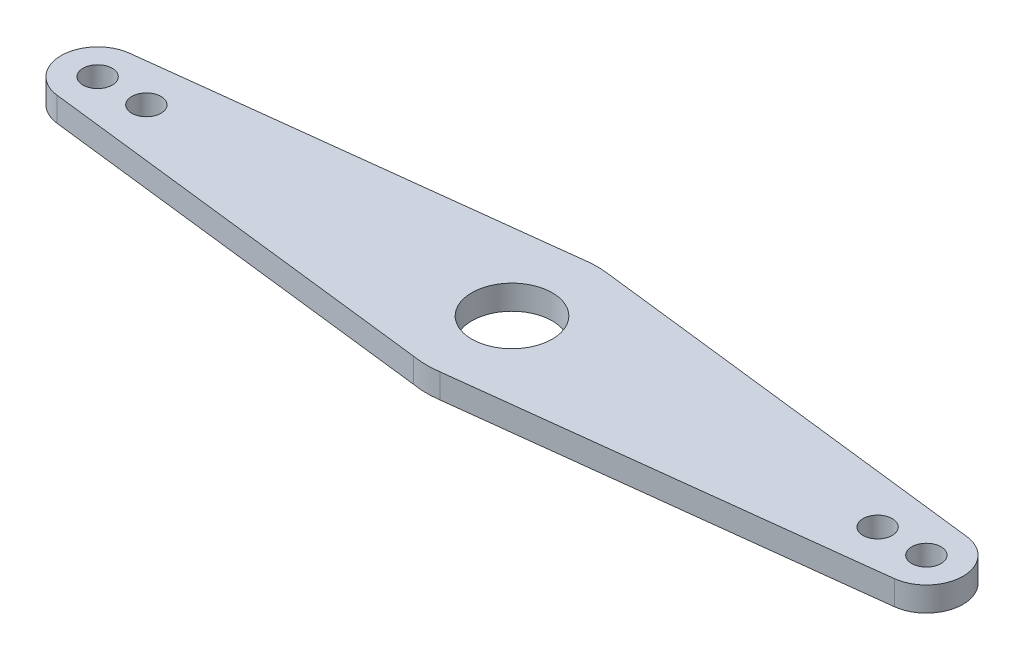
ISO-10303-21;
HEADER;
FILE_DESCRIPTION(('STEP AP214'),'2;1');
FILE_NAME('part.step','',(''),(''),'','','');
FILE_SCHEMA(('AUTOMOTIVE_DESIGN { 1 0 10303 214 1 1 1 1 }'));
ENDSEC;
DATA;
#1=APPLICATION_CONTEXT('core data for automotive mechanical design processes');
#2=APPLICATION_PROTOCOL_DEFINITION('international standard','automotive_design',2000,#1);
#3=PRODUCT_CONTEXT('',#1,'mechanical');
#4=PRODUCT('Part','Part','',(#3));
#5=PRODUCT_RELATED_PRODUCT_CATEGORY('part','',(#4));
#6=PRODUCT_DEFINITION_FORMATION('','',#4);
#7=PRODUCT_DEFINITION_CONTEXT('part definition',#1,'design');
#8=PRODUCT_DEFINITION('design','',#6,#7);
#9=PRODUCT_DEFINITION_SHAPE('','',#8);
#10=(LENGTH_UNIT() NAMED_UNIT(*) SI_UNIT(.MILLI.,.METRE.));
#11=(NAMED_UNIT(*) PLANE_ANGLE_UNIT() SI_UNIT($,.RADIAN.));
#12=(NAMED_UNIT(*) SI_UNIT($,.STERADIAN.) SOLID_ANGLE_UNIT());
#13=UNCERTAINTY_MEASURE_WITH_UNIT(LENGTH_MEASURE(1.E-05),#10,'distance_accuracy_value','');
#14=(GEOMETRIC_REPRESENTATION_CONTEXT(3) GLOBAL_UNCERTAINTY_ASSIGNED_CONTEXT((#13)) GLOBAL_UNIT_ASSIGNED_CONTEXT((#10,
#11,#12)) REPRESENTATION_CONTEXT('',''));
#15=CARTESIAN_POINT('',(0.,0.,0.));
#16=DIRECTION('',(0.,0.,1.));
#17=DIRECTION('',(1.,0.,0.));
#18=AXIS2_PLACEMENT_3D('',#15,#16,#17);
#19=CARTESIAN_POINT('',(-170.,10.,0.));
#20=DIRECTION('',(0.,-1.,0.));
#21=DIRECTION('',(0.,0.,-1.));
#22=AXIS2_PLACEMENT_3D('',#19,#20,#21);
#23=CYLINDRICAL_SURFACE('',#22,15.);
#24=CARTESIAN_POINT('',(-170.,0.,0.));
#25=DIRECTION('',(0.,1.,0.));
#26=DIRECTION('',(0.,0.,1.));
#27=AXIS2_PLACEMENT_3D('',#24,#25,#26);
#28=CIRCLE('',#27,15.);
#29=CARTESIAN_POINT('',(-171.764705882353,0.,-14.8958320730595));
#30=VERTEX_POINT('',#29);
#31=CARTESIAN_POINT('',(-171.759908797174,0.,14.896399599421));
#32=VERTEX_POINT('',#31);
#33=EDGE_CURVE('E135',#30,#32,#28,.T.);
#34=ORIENTED_EDGE('',*,*,#33,.T.);
#35=DIRECTION('',(0.,-1.,0.));
#36=VECTOR('',#35,1.);
#37=CARTESIAN_POINT('',(-171.759908797174,10.,14.896399599421));
#38=LINE('',#37,#36);
#39=CARTESIAN_POINT('',(-171.759908797174,10.,14.896399599421));
#40=VERTEX_POINT('',#39);
#41=EDGE_CURVE('E11',#40,#32,#38,.T.);
#42=ORIENTED_EDGE('',*,*,#41,.F.);
#43=CARTESIAN_POINT('',(-170.,10.,0.));
#44=DIRECTION('',(0.,1.,0.));
#45=DIRECTION('',(0.,0.,1.));
#46=AXIS2_PLACEMENT_3D('',#43,#44,#45);
#47=CIRCLE('',#46,15.);
#48=CARTESIAN_POINT('',(-171.764705882353,10.,-14.8958320730595));
#49=VERTEX_POINT('',#48);
#50=EDGE_CURVE('E150',#49,#40,#47,.T.);
#51=ORIENTED_EDGE('',*,*,#50,.F.);
#52=DIRECTION('',(0.,-1.,0.));
#53=VECTOR('',#52,1.);
#54=CARTESIAN_POINT('',(-171.764705882353,10.,-14.8958320730595));
#55=LINE('',#54,#53);
#56=EDGE_CURVE('E131',#49,#30,#55,.T.);
#57=ORIENTED_EDGE('',*,*,#56,.T.);
#58=EDGE_LOOP('',(#34,#42,#51,#57));
#59=FACE_BOUND('',#58,.T.);
#60=ADVANCED_FACE('F39',(#59),#23,.T.);
#61=CARTESIAN_POINT('',(-6.03666610789498,10.,34.4754791453548));
#62=DIRECTION('',(0.117327253144939,0.,-0.993093306628065));
#63=DIRECTION('',(-0.993093306628065,0.,-0.117327253144939));
#64=AXIS2_PLACEMENT_3D('',#61,#62,#63);
#65=PLANE('',#64);
#66=DIRECTION('',(0.993093306628065,0.,0.117327253144939));
#67=VECTOR('',#66,1.);
#68=CARTESIAN_POINT('',(-6.03666610789498,0.,34.4754791453548));
#69=LINE('',#68,#67);
#70=CARTESIAN_POINT('',(-6.03666610789498,0.,34.4754791453548));
#71=VERTEX_POINT('',#70);
#72=EDGE_CURVE('E138',#32,#71,#69,.T.);
#73=ORIENTED_EDGE('',*,*,#72,.T.);
#74=DIRECTION('',(0.,-1.,0.));
#75=VECTOR('',#74,1.);
#76=CARTESIAN_POINT('',(-6.03666610789498,10.,34.4754791453548));
#77=LINE('',#76,#75);
#78=CARTESIAN_POINT('',(-6.03666610789498,10.,34.4754791453548));
#79=VERTEX_POINT('',#78);
#80=EDGE_CURVE('E47',#79,#71,#77,.T.);
#81=ORIENTED_EDGE('',*,*,#80,.F.);
#82=DIRECTION('',(0.993093306628065,0.,0.117327253144939));
#83=VECTOR('',#82,1.);
#84=CARTESIAN_POINT('',(-6.03666610789498,10.,34.4754791453548));
#85=LINE('',#84,#83);
#86=EDGE_CURVE('E98',#40,#79,#85,.T.);
#87=ORIENTED_EDGE('',*,*,#86,.F.);
#88=ORIENTED_EDGE('',*,*,#41,.T.);
#89=EDGE_LOOP('',(#73,#81,#87,#88));
#90=FACE_BOUND('',#89,.T.);
#91=ADVANCED_FACE('F250',(#90),#65,.F.);
#92=CARTESIAN_POINT('',(0.,10.,0.));
#93=DIRECTION('',(0.,-1.,0.));
#94=DIRECTION('',(0.,0.,-1.));
#95=AXIS2_PLACEMENT_3D('',#92,#93,#94);
#96=CYLINDRICAL_SURFACE('',#95,35.);
#97=CARTESIAN_POINT('',(0.,0.,0.));
#98=DIRECTION('',(0.,1.,0.));
#99=DIRECTION('',(0.,0.,1.));
#100=AXIS2_PLACEMENT_3D('',#97,#98,#99);
#101=CIRCLE('',#100,35.);
#102=CARTESIAN_POINT('',(5.11868310567351,0.,34.6236780724361));
#103=VERTEX_POINT('',#102);
#104=EDGE_CURVE('E141',#71,#103,#101,.T.);
#105=ORIENTED_EDGE('',*,*,#104,.T.);
#106=DIRECTION('',(0.,-1.,0.));
#107=VECTOR('',#106,1.);
#108=CARTESIAN_POINT('',(5.11868310567351,10.,34.6236780724361));
#109=LINE('',#108,#107);
#110=CARTESIAN_POINT('',(5.11868310567351,10.,34.6236780724361));
#111=VERTEX_POINT('',#110);
#112=EDGE_CURVE('E157',#111,#103,#109,.T.);
#113=ORIENTED_EDGE('',*,*,#112,.F.);
#114=CARTESIAN_POINT('',(0.,10.,0.));
#115=DIRECTION('',(0.,1.,0.));
#116=DIRECTION('',(0.,0.,1.));
#117=AXIS2_PLACEMENT_3D('',#114,#115,#116);
#118=CIRCLE('',#117,35.);
#119=EDGE_CURVE('E165',#79,#111,#118,.T.);
#120=ORIENTED_EDGE('',*,*,#119,.F.);
#121=ORIENTED_EDGE('',*,*,#80,.T.);
#122=EDGE_LOOP('',(#105,#113,#120,#121));
#123=FACE_BOUND('',#122,.T.);
#124=ADVANCED_FACE('F163',(#123),#96,.T.);
#125=CARTESIAN_POINT('',(5.11868310567351,10.,34.6236780724361));
#126=DIRECTION('',(-0.117560842167454,0.,-0.99306568181006));
#127=DIRECTION('',(-0.99306568181006,0.,0.117560842167454));
#128=AXIS2_PLACEMENT_3D('',#125,#126,#127);
#129=PLANE('',#128);
#130=DIRECTION('',(0.99306568181006,0.,-0.117560842167454));
#131=VECTOR('',#130,1.);
#132=CARTESIAN_POINT('',(5.11868310567351,0.,34.6236780724361));
#133=LINE('',#132,#131);
#134=CARTESIAN_POINT('',(171.763412632512,0.,14.8959852271509));
#135=VERTEX_POINT('',#134);
#136=EDGE_CURVE('E143',#103,#135,#133,.T.);
#137=ORIENTED_EDGE('',*,*,#136,.T.);
#138=DIRECTION('',(0.,-1.,0.));
#139=VECTOR('',#138,1.);
#140=CARTESIAN_POINT('',(171.763412632512,10.,14.8959852271509));
#141=LINE('',#140,#139);
#142=CARTESIAN_POINT('',(171.763412632512,10.,14.8959852271509));
#143=VERTEX_POINT('',#142);
#144=EDGE_CURVE('E154',#143,#135,#141,.T.);
#145=ORIENTED_EDGE('',*,*,#144,.F.);
#146=DIRECTION('',(0.99306568181006,0.,-0.117560842167454));
#147=VECTOR('',#146,1.);
#148=CARTESIAN_POINT('',(5.11868310567351,10.,34.6236780724361));
#149=LINE('',#148,#147);
#150=EDGE_CURVE('E177',#111,#143,#149,.T.);
#151=ORIENTED_EDGE('',*,*,#150,.F.);
#152=ORIENTED_EDGE('',*,*,#112,.T.);
#153=EDGE_LOOP('',(#137,#145,#151,#152));
#154=FACE_BOUND('',#153,.T.);
#155=ADVANCED_FACE('F173',(#154),#129,.F.);
#156=CARTESIAN_POINT('',(170.,10.,0.));
#157=DIRECTION('',(0.,-1.,0.));
#158=DIRECTION('',(0.,0.,-1.));
#159=AXIS2_PLACEMENT_3D('',#156,#157,#158);
#160=CYLINDRICAL_SURFACE('',#159,15.);
#161=CARTESIAN_POINT('',(170.,0.,0.));
#162=DIRECTION('',(0.,1.,0.));
#163=DIRECTION('',(0.,0.,1.));
#164=AXIS2_PLACEMENT_3D('',#161,#162,#163);
#165=CIRCLE('',#164,15.);
#166=CARTESIAN_POINT('',(171.764705882353,0.,-14.8958320730596));
#167=VERTEX_POINT('',#166);
#168=EDGE_CURVE('E145',#135,#167,#165,.T.);
#169=ORIENTED_EDGE('',*,*,#168,.T.);
#170=DIRECTION('',(0.,-1.,0.));
#171=VECTOR('',#170,1.);
#172=CARTESIAN_POINT('',(171.764705882353,10.,-14.8958320730596));
#173=LINE('',#172,#171);
#174=CARTESIAN_POINT('',(171.764705882353,10.,-14.8958320730596));
#175=VERTEX_POINT('',#174);
#176=EDGE_CURVE('E126',#175,#167,#173,.T.);
#177=ORIENTED_EDGE('',*,*,#176,.F.);
#178=CARTESIAN_POINT('',(170.,10.,0.));
#179=DIRECTION('',(0.,1.,0.));
#180=DIRECTION('',(0.,0.,1.));
#181=AXIS2_PLACEMENT_3D('',#178,#179,#180);
#182=CIRCLE('',#181,15.);
#183=EDGE_CURVE('E117',#143,#175,#182,.T.);
#184=ORIENTED_EDGE('',*,*,#183,.F.);
#185=ORIENTED_EDGE('',*,*,#144,.T.);
#186=EDGE_LOOP('',(#169,#177,#184,#185));
#187=FACE_BOUND('',#186,.T.);
#188=ADVANCED_FACE('F176',(#187),#160,.T.);
#189=CARTESIAN_POINT('',(4.11764705882353,10.,-34.7569415038056));
#190=DIRECTION('',(-0.117647058823529,0.,0.993055471537302));
#191=DIRECTION('',(0.993055471537302,0.,0.117647058823529));
#192=AXIS2_PLACEMENT_3D('',#189,#190,#191);
#193=PLANE('',#192);
#194=DIRECTION('',(-0.993055471537302,0.,-0.117647058823529));
#195=VECTOR('',#194,1.);
#196=CARTESIAN_POINT('',(4.11764705882353,0.,-34.7569415038056));
#197=LINE('',#196,#195);
#198=CARTESIAN_POINT('',(4.11764705882353,0.,-34.7569415038056));
#199=VERTEX_POINT('',#198);
#200=EDGE_CURVE('E125',#167,#199,#197,.T.);
#201=ORIENTED_EDGE('',*,*,#200,.T.);
#202=DIRECTION('',(0.,-1.,0.));
#203=VECTOR('',#202,1.);
#204=CARTESIAN_POINT('',(4.11764705882353,10.,-34.7569415038056));
#205=LINE('',#204,#203);
#206=CARTESIAN_POINT('',(4.11764705882353,10.,-34.7569415038056));
#207=VERTEX_POINT('',#206);
#208=EDGE_CURVE('E122',#207,#199,#205,.T.);
#209=ORIENTED_EDGE('',*,*,#208,.F.);
#210=DIRECTION('',(-0.993055471537302,0.,-0.117647058823529));
#211=VECTOR('',#210,1.);
#212=CARTESIAN_POINT('',(4.11764705882353,10.,-34.7569415038056));
#213=LINE('',#212,#211);
#214=EDGE_CURVE('E111',#175,#207,#213,.T.);
#215=ORIENTED_EDGE('',*,*,#214,.F.);
#216=ORIENTED_EDGE('',*,*,#176,.T.);
#217=EDGE_LOOP('',(#201,#209,#215,#216));
#218=FACE_BOUND('',#217,.T.);
#219=ADVANCED_FACE('F123',(#218),#193,.F.);
#220=CARTESIAN_POINT('',(0.,10.,0.));
#221=DIRECTION('',(0.,-1.,0.));
#222=DIRECTION('',(0.,0.,-1.));
#223=AXIS2_PLACEMENT_3D('',#220,#221,#222);
#224=CYLINDRICAL_SURFACE('',#223,35.);
#225=CARTESIAN_POINT('',(0.,0.,0.));
#226=DIRECTION('',(0.,1.,0.));
#227=DIRECTION('',(0.,0.,1.));
#228=AXIS2_PLACEMENT_3D('',#225,#226,#227);
#229=CIRCLE('',#228,35.);
#230=CARTESIAN_POINT('',(-4.11764705882353,0.,-34.7569415038056));
#231=VERTEX_POINT('',#230);
#232=EDGE_CURVE('E84',#199,#231,#229,.T.);
#233=ORIENTED_EDGE('',*,*,#232,.T.);
#234=DIRECTION('',(0.,-1.,0.));
#235=VECTOR('',#234,1.);
#236=CARTESIAN_POINT('',(-4.11764705882353,10.,-34.7569415038056));
#237=LINE('',#236,#235);
#238=CARTESIAN_POINT('',(-4.11764705882353,10.,-34.7569415038056));
#239=VERTEX_POINT('',#238);
#240=EDGE_CURVE('E127',#239,#231,#237,.T.);
#241=ORIENTED_EDGE('',*,*,#240,.F.);
#242=CARTESIAN_POINT('',(0.,10.,0.));
#243=DIRECTION('',(0.,1.,0.));
#244=DIRECTION('',(0.,0.,1.));
#245=AXIS2_PLACEMENT_3D('',#242,#243,#244);
#246=CIRCLE('',#245,35.);
#247=EDGE_CURVE('E115',#207,#239,#246,.T.);
#248=ORIENTED_EDGE('',*,*,#247,.F.);
#249=ORIENTED_EDGE('',*,*,#208,.T.);
#250=EDGE_LOOP('',(#233,#241,#248,#249));
#251=FACE_BOUND('',#250,.T.);
#252=ADVANCED_FACE('F129',(#251),#224,.T.);
#253=CARTESIAN_POINT('',(-171.764705882353,10.,-14.8958320730595));
#254=DIRECTION('',(0.11764705882353,0.,0.993055471537302));
#255=DIRECTION('',(0.993055471537302,0.,-0.11764705882353));
#256=AXIS2_PLACEMENT_3D('',#253,#254,#255);
#257=PLANE('',#256);
#258=DIRECTION('',(-0.993055471537302,0.,0.11764705882353));
#259=VECTOR('',#258,1.);
#260=CARTESIAN_POINT('',(-171.764705882353,0.,-14.8958320730595));
#261=LINE('',#260,#259);
#262=EDGE_CURVE('E90',#231,#30,#261,.T.);
#263=ORIENTED_EDGE('',*,*,#262,.T.);
#264=ORIENTED_EDGE('',*,*,#56,.F.);
#265=DIRECTION('',(-0.993055471537302,0.,0.11764705882353));
#266=VECTOR('',#265,1.);
#267=CARTESIAN_POINT('',(-171.764705882353,10.,-14.8958320730595));
#268=LINE('',#267,#266);
#269=EDGE_CURVE('E55',#239,#49,#268,.T.);
#270=ORIENTED_EDGE('',*,*,#269,.F.);
#271=ORIENTED_EDGE('',*,*,#240,.T.);
#272=EDGE_LOOP('',(#263,#264,#270,#271));
#273=FACE_BOUND('',#272,.T.);
#274=ADVANCED_FACE('F224',(#273),#257,.F.);
#275=CARTESIAN_POINT('',(-170.,10.,0.));
#276=DIRECTION('',(0.,1.,0.));
#277=DIRECTION('',(0.,0.,1.));
#278=AXIS2_PLACEMENT_3D('',#275,#276,#277);
#279=PLANE('',#278);
#280=CARTESIAN_POINT('',(0.,10.,0.));
#281=DIRECTION('',(0.,1.,0.));
#282=DIRECTION('',(0.,0.,1.));
#283=AXIS2_PLACEMENT_3D('',#280,#281,#282);
#284=CIRCLE('',#283,16.5);
#285=CARTESIAN_POINT('',(0.,10.,16.5));
#286=VERTEX_POINT('',#285);
#287=EDGE_CURVE('E207',#286,#286,#284,.T.);
#288=ORIENTED_EDGE('',*,*,#287,.F.);
#289=EDGE_LOOP('',(#288));
#290=FACE_BOUND('',#289,.T.);
#291=CARTESIAN_POINT('',(170.,10.,0.));
#292=DIRECTION('',(0.,1.,0.));
#293=DIRECTION('',(0.,0.,1.));
#294=AXIS2_PLACEMENT_3D('',#291,#292,#293);
#295=CIRCLE('',#294,6.00000000000002);
#296=CARTESIAN_POINT('',(170.,10.,5.99999999999999));
#297=VERTEX_POINT('',#296);
#298=EDGE_CURVE('E202',#297,#297,#295,.T.);
#299=ORIENTED_EDGE('',*,*,#298,.F.);
#300=EDGE_LOOP('',(#299));
#301=FACE_BOUND('',#300,.T.);
#302=CARTESIAN_POINT('',(-170.,10.,0.));
#303=DIRECTION('',(0.,1.,0.));
#304=DIRECTION('',(0.,0.,1.));
#305=AXIS2_PLACEMENT_3D('',#302,#303,#304);
#306=CIRCLE('',#305,6.00000000000002);
#307=CARTESIAN_POINT('',(-170.,10.,6.00000000000004));
#308=VERTEX_POINT('',#307);
#309=EDGE_CURVE('E199',#308,#308,#306,.T.);
#310=ORIENTED_EDGE('',*,*,#309,.F.);
#311=EDGE_LOOP('',(#310));
#312=FACE_BOUND('',#311,.T.);
#313=CARTESIAN_POINT('',(-150.,10.,0.));
#314=DIRECTION('',(0.,1.,0.));
#315=DIRECTION('',(0.,0.,1.));
#316=AXIS2_PLACEMENT_3D('',#313,#314,#315);
#317=CIRCLE('',#316,6.00000000000002);
#318=CARTESIAN_POINT('',(-150.,10.,6.00000000000004));
#319=VERTEX_POINT('',#318);
#320=EDGE_CURVE('E193',#319,#319,#317,.T.);
#321=ORIENTED_EDGE('',*,*,#320,.F.);
#322=EDGE_LOOP('',(#321));
#323=FACE_BOUND('',#322,.T.);
#324=CARTESIAN_POINT('',(150.,10.,0.));
#325=DIRECTION('',(0.,1.,0.));
#326=DIRECTION('',(0.,0.,1.));
#327=AXIS2_PLACEMENT_3D('',#324,#325,#326);
#328=CIRCLE('',#327,6.00000000000002);
#329=CARTESIAN_POINT('',(150.,10.,5.99999999999999));
#330=VERTEX_POINT('',#329);
#331=EDGE_CURVE('E186',#330,#330,#328,.T.);
#332=ORIENTED_EDGE('',*,*,#331,.F.);
#333=EDGE_LOOP('',(#332));
#334=FACE_BOUND('',#333,.T.);
#335=ORIENTED_EDGE('',*,*,#50,.T.);
#336=ORIENTED_EDGE('',*,*,#86,.T.);
#337=ORIENTED_EDGE('',*,*,#119,.T.);
#338=ORIENTED_EDGE('',*,*,#150,.T.);
#339=ORIENTED_EDGE('',*,*,#183,.T.);
#340=ORIENTED_EDGE('',*,*,#214,.T.);
#341=ORIENTED_EDGE('',*,*,#247,.T.);
#342=ORIENTED_EDGE('',*,*,#269,.T.);
#343=EDGE_LOOP('',(#335,#336,#337,#338,#339,#340,#341,#342));
#344=FACE_BOUND('',#343,.T.);
#345=ADVANCED_FACE('F113',(#290,#301,#312,#323,#334,#344),#279,.T.);
#346=CARTESIAN_POINT('',(-170.,0.,0.));
#347=DIRECTION('',(0.,1.,0.));
#348=DIRECTION('',(0.,0.,1.));
#349=AXIS2_PLACEMENT_3D('',#346,#347,#348);
#350=PLANE('',#349);
#351=CARTESIAN_POINT('',(0.,0.,0.));
#352=DIRECTION('',(0.,1.,0.));
#353=DIRECTION('',(0.,0.,1.));
#354=AXIS2_PLACEMENT_3D('',#351,#352,#353);
#355=CIRCLE('',#354,16.5);
#356=CARTESIAN_POINT('',(0.,0.,16.5));
#357=VERTEX_POINT('',#356);
#358=EDGE_CURVE('E187',#357,#357,#355,.T.);
#359=ORIENTED_EDGE('',*,*,#358,.T.);
#360=EDGE_LOOP('',(#359));
#361=FACE_BOUND('',#360,.T.);
#362=CARTESIAN_POINT('',(170.,0.,0.));
#363=DIRECTION('',(0.,1.,0.));
#364=DIRECTION('',(0.,0.,1.));
#365=AXIS2_PLACEMENT_3D('',#362,#363,#364);
#366=CIRCLE('',#365,6.00000000000002);
#367=CARTESIAN_POINT('',(170.,0.,5.99999999999999));
#368=VERTEX_POINT('',#367);
#369=EDGE_CURVE('E139',#368,#368,#366,.T.);
#370=ORIENTED_EDGE('',*,*,#369,.T.);
#371=EDGE_LOOP('',(#370));
#372=FACE_BOUND('',#371,.T.);
#373=CARTESIAN_POINT('',(-170.,0.,0.));
#374=DIRECTION('',(0.,1.,0.));
#375=DIRECTION('',(0.,0.,1.));
#376=AXIS2_PLACEMENT_3D('',#373,#374,#375);
#377=CIRCLE('',#376,6.00000000000002);
#378=CARTESIAN_POINT('',(-170.,0.,6.00000000000004));
#379=VERTEX_POINT('',#378);
#380=EDGE_CURVE('E196',#379,#379,#377,.T.);
#381=ORIENTED_EDGE('',*,*,#380,.T.);
#382=EDGE_LOOP('',(#381));
#383=FACE_BOUND('',#382,.T.);
#384=CARTESIAN_POINT('',(-150.,0.,0.));
#385=DIRECTION('',(0.,1.,0.));
#386=DIRECTION('',(0.,0.,1.));
#387=AXIS2_PLACEMENT_3D('',#384,#385,#386);
#388=CIRCLE('',#387,6.00000000000002);
#389=CARTESIAN_POINT('',(-150.,0.,6.00000000000004));
#390=VERTEX_POINT('',#389);
#391=EDGE_CURVE('E190',#390,#390,#388,.T.);
#392=ORIENTED_EDGE('',*,*,#391,.T.);
#393=EDGE_LOOP('',(#392));
#394=FACE_BOUND('',#393,.T.);
#395=CARTESIAN_POINT('',(150.,0.,0.));
#396=DIRECTION('',(0.,1.,0.));
#397=DIRECTION('',(0.,0.,1.));
#398=AXIS2_PLACEMENT_3D('',#395,#396,#397);
#399=CIRCLE('',#398,6.00000000000002);
#400=CARTESIAN_POINT('',(150.,0.,5.99999999999999));
#401=VERTEX_POINT('',#400);
#402=EDGE_CURVE('E183',#401,#401,#399,.T.);
#403=ORIENTED_EDGE('',*,*,#402,.T.);
#404=EDGE_LOOP('',(#403));
#405=FACE_BOUND('',#404,.T.);
#406=ORIENTED_EDGE('',*,*,#33,.F.);
#407=ORIENTED_EDGE('',*,*,#262,.F.);
#408=ORIENTED_EDGE('',*,*,#232,.F.);
#409=ORIENTED_EDGE('',*,*,#200,.F.);
#410=ORIENTED_EDGE('',*,*,#168,.F.);
#411=ORIENTED_EDGE('',*,*,#136,.F.);
#412=ORIENTED_EDGE('',*,*,#104,.F.);
#413=ORIENTED_EDGE('',*,*,#72,.F.);
#414=EDGE_LOOP('',(#406,#407,#408,#409,#410,#411,#412,#413));
#415=FACE_BOUND('',#414,.T.);
#416=ADVANCED_FACE('F169',(#361,#372,#383,#394,#405,#415),#350,.F.);
#417=CARTESIAN_POINT('',(150.,0.,0.));
#418=DIRECTION('',(0.,1.,0.));
#419=DIRECTION('',(0.,0.,1.));
#420=AXIS2_PLACEMENT_3D('',#417,#418,#419);
#421=CYLINDRICAL_SURFACE('',#420,6.00000000000002);
#422=ORIENTED_EDGE('',*,*,#402,.F.);
#423=EDGE_LOOP('',(#422));
#424=FACE_BOUND('',#423,.T.);
#425=ORIENTED_EDGE('',*,*,#331,.T.);
#426=EDGE_LOOP('',(#425));
#427=FACE_BOUND('',#426,.T.);
#428=ADVANCED_FACE('F234',(#424,#427),#421,.F.);
#429=CARTESIAN_POINT('',(-150.,0.,0.));
#430=DIRECTION('',(0.,1.,0.));
#431=DIRECTION('',(0.,0.,1.));
#432=AXIS2_PLACEMENT_3D('',#429,#430,#431);
#433=CYLINDRICAL_SURFACE('',#432,6.00000000000002);
#434=ORIENTED_EDGE('',*,*,#391,.F.);
#435=EDGE_LOOP('',(#434));
#436=FACE_BOUND('',#435,.T.);
#437=ORIENTED_EDGE('',*,*,#320,.T.);
#438=EDGE_LOOP('',(#437));
#439=FACE_BOUND('',#438,.T.);
#440=ADVANCED_FACE('F236',(#436,#439),#433,.F.);
#441=CARTESIAN_POINT('',(-170.,0.,0.));
#442=DIRECTION('',(0.,1.,0.));
#443=DIRECTION('',(0.,0.,1.));
#444=AXIS2_PLACEMENT_3D('',#441,#442,#443);
#445=CYLINDRICAL_SURFACE('',#444,6.00000000000002);
#446=ORIENTED_EDGE('',*,*,#380,.F.);
#447=EDGE_LOOP('',(#446));
#448=FACE_BOUND('',#447,.T.);
#449=ORIENTED_EDGE('',*,*,#309,.T.);
#450=EDGE_LOOP('',(#449));
#451=FACE_BOUND('',#450,.T.);
#452=ADVANCED_FACE('F243',(#448,#451),#445,.F.);
#453=CARTESIAN_POINT('',(170.,0.,0.));
#454=DIRECTION('',(0.,1.,0.));
#455=DIRECTION('',(0.,0.,1.));
#456=AXIS2_PLACEMENT_3D('',#453,#454,#455);
#457=CYLINDRICAL_SURFACE('',#456,6.00000000000002);
#458=ORIENTED_EDGE('',*,*,#369,.F.);
#459=EDGE_LOOP('',(#458));
#460=FACE_BOUND('',#459,.T.);
#461=ORIENTED_EDGE('',*,*,#298,.T.);
#462=EDGE_LOOP('',(#461));
#463=FACE_BOUND('',#462,.T.);
#464=ADVANCED_FACE('F218',(#460,#463),#457,.F.);
#465=CARTESIAN_POINT('',(0.,0.,0.));
#466=DIRECTION('',(0.,1.,0.));
#467=DIRECTION('',(0.,0.,1.));
#468=AXIS2_PLACEMENT_3D('',#465,#466,#467);
#469=CYLINDRICAL_SURFACE('',#468,16.5);
#470=ORIENTED_EDGE('',*,*,#358,.F.);
#471=EDGE_LOOP('',(#470));
#472=FACE_BOUND('',#471,.T.);
#473=ORIENTED_EDGE('',*,*,#287,.T.);
#474=EDGE_LOOP('',(#473));
#475=FACE_BOUND('',#474,.T.);
#476=ADVANCED_FACE('F215',(#472,#475),#469,.F.);
#477=CLOSED_SHELL('',(#60,#91,#124,#155,#188,#219,#252,#274,#345,#416,#428,#440,#452,#464,#476));
#478=MANIFOLD_SOLID_BREP('B2',#477);
#479=ADVANCED_BREP_SHAPE_REPRESENTATION('',(#18,#478),#14);
#480=SHAPE_DEFINITION_REPRESENTATION(#9,#479);
ENDSEC;
END-ISO-10303-21;
